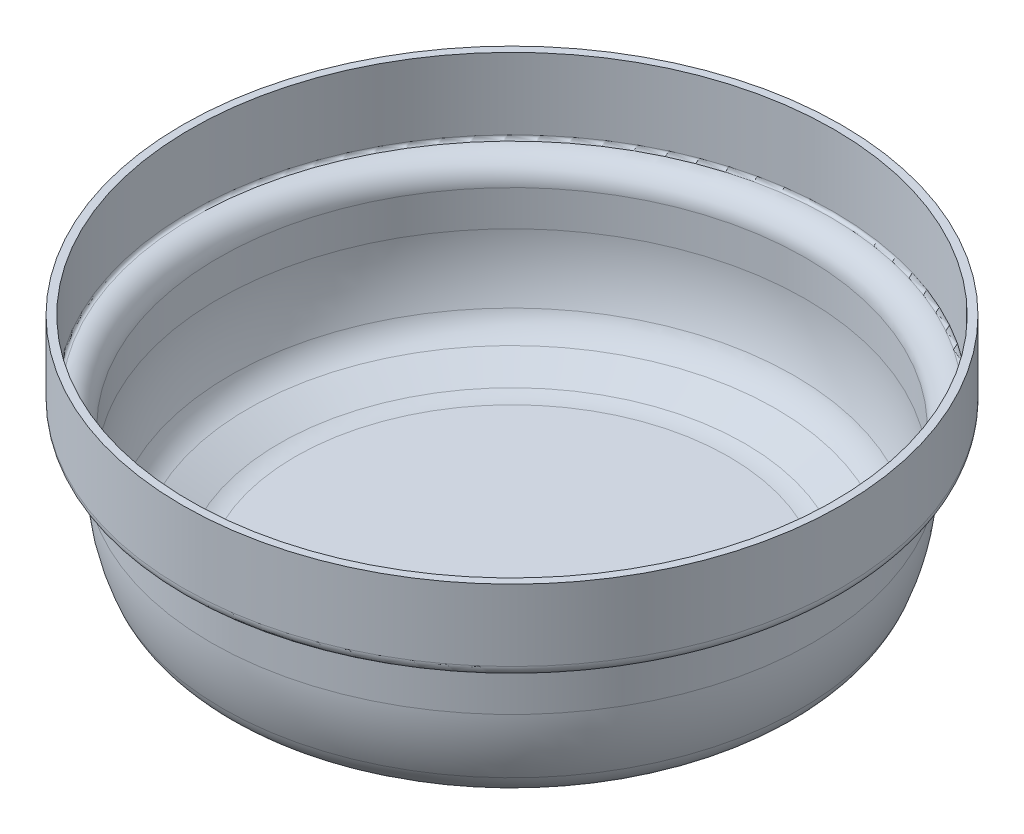
ISO-10303-21;
HEADER;
FILE_DESCRIPTION(('STEP AP214'),'2;1');
FILE_NAME('part.step','',(''),(''),'','','');
FILE_SCHEMA(('AUTOMOTIVE_DESIGN { 1 0 10303 214 1 1 1 1 }'));
ENDSEC;
DATA;
#1=APPLICATION_CONTEXT('core data for automotive mechanical design processes');
#2=APPLICATION_PROTOCOL_DEFINITION('international standard','automotive_design',2000,#1);
#3=PRODUCT_CONTEXT('',#1,'mechanical');
#4=PRODUCT('Part','Part','',(#3));
#5=PRODUCT_RELATED_PRODUCT_CATEGORY('part','',(#4));
#6=PRODUCT_DEFINITION_FORMATION('','',#4);
#7=PRODUCT_DEFINITION_CONTEXT('part definition',#1,'design');
#8=PRODUCT_DEFINITION('design','',#6,#7);
#9=PRODUCT_DEFINITION_SHAPE('','',#8);
#10=(LENGTH_UNIT() NAMED_UNIT(*) SI_UNIT(.MILLI.,.METRE.));
#11=(NAMED_UNIT(*) PLANE_ANGLE_UNIT() SI_UNIT($,.RADIAN.));
#12=(NAMED_UNIT(*) SI_UNIT($,.STERADIAN.) SOLID_ANGLE_UNIT());
#13=UNCERTAINTY_MEASURE_WITH_UNIT(LENGTH_MEASURE(1.E-05),#10,'distance_accuracy_value','');
#14=(GEOMETRIC_REPRESENTATION_CONTEXT(3) GLOBAL_UNCERTAINTY_ASSIGNED_CONTEXT((#13)) GLOBAL_UNIT_ASSIGNED_CONTEXT((#10,
#11,#12)) REPRESENTATION_CONTEXT('',''));
#15=CARTESIAN_POINT('',(0.,0.,0.));
#16=DIRECTION('',(0.,0.,1.));
#17=DIRECTION('',(1.,0.,0.));
#18=AXIS2_PLACEMENT_3D('',#15,#16,#17);
#19=CARTESIAN_POINT('',(0.,113.365316058993,0.));
#20=DIRECTION('',(0.,1.,0.));
#21=DIRECTION('',(0.,0.,1.));
#22=AXIS2_PLACEMENT_3D('',#19,#20,#21);
#23=PLANE('',#22);
#24=CARTESIAN_POINT('',(0.,113.365316058993,0.));
#25=DIRECTION('',(0.,-1.,0.));
#26=DIRECTION('',(0.,0.,-1.));
#27=AXIS2_PLACEMENT_3D('',#24,#25,#26);
#28=CIRCLE('',#27,135.355289406168);
#29=CARTESIAN_POINT('',(0.,113.365316058993,-135.355289406168));
#30=VERTEX_POINT('',#29);
#31=EDGE_CURVE('E66',#30,#30,#28,.T.);
#32=ORIENTED_EDGE('',*,*,#31,.T.);
#33=EDGE_LOOP('',(#32));
#34=FACE_BOUND('',#33,.T.);
#35=CARTESIAN_POINT('',(0.,113.365316058993,0.));
#36=DIRECTION('',(0.,-1.,0.));
#37=DIRECTION('',(0.,0.,-1.));
#38=AXIS2_PLACEMENT_3D('',#35,#36,#37);
#39=CIRCLE('',#38,138.555289406168);
#40=CARTESIAN_POINT('',(0.,113.365316058993,-138.555289406168));
#41=VERTEX_POINT('',#40);
#42=EDGE_CURVE('E73',#41,#41,#39,.T.);
#43=ORIENTED_EDGE('',*,*,#42,.F.);
#44=EDGE_LOOP('',(#43));
#45=FACE_BOUND('',#44,.T.);
#46=ADVANCED_FACE('F35',(#34,#45),#23,.T.);
#47=CARTESIAN_POINT('',(0.,14.832128030832,99.2127252525066));
#48=CARTESIAN_POINT('',(0.,13.6614165071201,96.7096580848795));
#49=CARTESIAN_POINT('',(0.,13.0472913738794,93.9930756489206));
#50=CARTESIAN_POINT('',(0.,13.0472913738795,91.1860000000004));
#51=(BOUNDED_CURVE() B_SPLINE_CURVE(3,(#47,#48,#49,#50),.UNSPECIFIED.,.F.,
.F.) B_SPLINE_CURVE_WITH_KNOTS((4,4),(0.,1.),
.UNSPECIFIED.) CURVE() GEOMETRIC_REPRESENTATION_ITEM() RATIONAL_B_SPLINE_CURVE((0.266833191114025,
0.258499793724843,0.254333095030252,0.254333095030252)) REPRESENTATION_ITEM(''));
#52=CARTESIAN_POINT('',(0.,55.,0.));
#53=DIRECTION('',(0.,-1.,0.));
#54=AXIS1_PLACEMENT('',#52,#53);
#55=SURFACE_OF_REVOLUTION('',#51,#54);
#56=OFFSET_SURFACE('',#55,-3.2,.F.);
#57=CARTESIAN_POINT('',(0.,16.2472913738796,0.));
#58=DIRECTION('',(0.,-1.,0.));
#59=DIRECTION('',(0.,0.,-1.));
#60=AXIS2_PLACEMENT_3D('',#57,#58,#59);
#61=CIRCLE('',#60,91.1860000000005);
#62=CARTESIAN_POINT('',(0.,16.2472913738796,-91.1860000000005));
#63=VERTEX_POINT('',#62);
#64=EDGE_CURVE('E50',#63,#63,#61,.T.);
#65=ORIENTED_EDGE('',*,*,#64,.T.);
#66=EDGE_LOOP('',(#65));
#67=FACE_BOUND('',#66,.T.);
#68=CARTESIAN_POINT('',(0.,17.7307532145668,0.));
#69=DIRECTION('',(0.,1.,0.));
#70=DIRECTION('',(0.,0.,1.));
#71=AXIS2_PLACEMENT_3D('',#68,#69,#70);
#72=CIRCLE('',#71,97.8570069763819);
#73=CARTESIAN_POINT('',(0.,17.7307532145668,97.8570069763819));
#74=VERTEX_POINT('',#73);
#75=EDGE_CURVE('E10',#74,#74,#72,.F.);
#76=ORIENTED_EDGE('',*,*,#75,.F.);
#77=EDGE_LOOP('',(#76));
#78=FACE_BOUND('',#77,.T.);
#79=ADVANCED_FACE('F87',(#67,#78),#56,.F.);
#80=CARTESIAN_POINT('',(0.,23.851107688811,0.));
#81=DIRECTION('',(0.,1.,0.));
#82=DIRECTION('',(0.,0.,1.));
#83=AXIS2_PLACEMENT_3D('',#80,#81,#82);
#84=CONICAL_SURFACE('',#83,110.942774074794,1.13331210913786);
#85=ORIENTED_EDGE('',*,*,#75,.T.);
#86=EDGE_LOOP('',(#85));
#87=FACE_BOUND('',#86,.T.);
#88=CARTESIAN_POINT('',(0.,23.851107688811,0.));
#89=DIRECTION('',(0.,-1.,0.));
#90=DIRECTION('',(0.,0.,-1.));
#91=AXIS2_PLACEMENT_3D('',#88,#89,#90);
#92=CIRCLE('',#91,110.942774074794);
#93=CARTESIAN_POINT('',(0.,23.851107688811,-110.942774074794));
#94=VERTEX_POINT('',#93);
#95=EDGE_CURVE('E42',#94,#94,#92,.T.);
#96=ORIENTED_EDGE('',*,*,#95,.F.);
#97=EDGE_LOOP('',(#96));
#98=FACE_BOUND('',#97,.T.);
#99=ADVANCED_FACE('F89',(#87,#98),#84,.F.);
#100=CARTESIAN_POINT('',(0.,37.6315363697442,0.));
#101=DIRECTION('',(0.,-1.,0.));
#102=DIRECTION('',(0.,0.,-1.));
#103=AXIS2_PLACEMENT_3D('',#100,#101,#102);
#104=TOROIDAL_SURFACE('',#103,104.49751888264,15.2132024610953);
#105=ORIENTED_EDGE('',*,*,#95,.T.);
#106=EDGE_LOOP('',(#105));
#107=FACE_BOUND('',#106,.T.);
#108=CARTESIAN_POINT('',(0.,32.0566764638808,0.));
#109=DIRECTION('',(0.,-1.,0.));
#110=DIRECTION('',(0.,0.,-1.));
#111=AXIS2_PLACEMENT_3D('',#108,#109,#110);
#112=CIRCLE('',#111,118.652463819031);
#113=CARTESIAN_POINT('',(0.,32.0566764638808,-118.652463819031));
#114=VERTEX_POINT('',#113);
#115=EDGE_CURVE('E47',#114,#114,#112,.T.);
#116=ORIENTED_EDGE('',*,*,#115,.F.);
#117=EDGE_LOOP('',(#116));
#118=FACE_BOUND('',#117,.T.);
#119=ADVANCED_FACE('F92',(#107,#118),#104,.F.);
#120=CARTESIAN_POINT('',(0.,57.5011211482528,0.));
#121=DIRECTION('',(0.,-1.,0.));
#122=DIRECTION('',(0.,0.,-1.));
#123=AXIS2_PLACEMENT_3D('',#120,#121,#122);
#124=DEGENERATE_TOROIDAL_SURFACE('',#123,54.0473043126088,69.4351956873913,.T.);
#125=ORIENTED_EDGE('',*,*,#115,.T.);
#126=EDGE_LOOP('',(#125));
#127=FACE_BOUND('',#126,.T.);
#128=CARTESIAN_POINT('',(0.,57.5011211482528,0.));
#129=DIRECTION('',(0.,-1.,0.));
#130=DIRECTION('',(0.,0.,-1.));
#131=AXIS2_PLACEMENT_3D('',#128,#129,#130);
#132=CIRCLE('',#131,123.4825);
#133=CARTESIAN_POINT('',(0.,57.5011211482528,-123.4825));
#134=VERTEX_POINT('',#133);
#135=EDGE_CURVE('E54',#134,#134,#132,.T.);
#136=ORIENTED_EDGE('',*,*,#135,.F.);
#137=EDGE_LOOP('',(#136));
#138=FACE_BOUND('',#137,.T.);
#139=ADVANCED_FACE('F95',(#127,#138),#124,.F.);
#140=CARTESIAN_POINT('',(0.,55.,0.));
#141=DIRECTION('',(0.,-1.,0.));
#142=DIRECTION('',(0.,0.,-1.));
#143=AXIS2_PLACEMENT_3D('',#140,#141,#142);
#144=CYLINDRICAL_SURFACE('',#143,123.4825);
#145=ORIENTED_EDGE('',*,*,#135,.T.);
#146=EDGE_LOOP('',(#145));
#147=FACE_BOUND('',#146,.T.);
#148=CARTESIAN_POINT('',(0.,72.5011211482528,0.));
#149=DIRECTION('',(0.,-1.,0.));
#150=DIRECTION('',(0.,0.,-1.));
#151=AXIS2_PLACEMENT_3D('',#148,#149,#150);
#152=CIRCLE('',#151,123.4825);
#153=CARTESIAN_POINT('',(0.,72.5011211482528,-123.4825));
#154=VERTEX_POINT('',#153);
#155=EDGE_CURVE('E57',#154,#154,#152,.T.);
#156=ORIENTED_EDGE('',*,*,#155,.F.);
#157=EDGE_LOOP('',(#156));
#158=FACE_BOUND('',#157,.T.);
#159=ADVANCED_FACE('F99',(#147,#158),#144,.F.);
#160=CARTESIAN_POINT('',(0.,72.5011211482528,0.));
#161=DIRECTION('',(0.,-1.,0.));
#162=DIRECTION('',(0.,0.,-1.));
#163=AXIS2_PLACEMENT_3D('',#160,#161,#162);
#164=TOROIDAL_SURFACE('',#163,133.0325,9.54999999999996);
#165=ORIENTED_EDGE('',*,*,#155,.T.);
#166=EDGE_LOOP('',(#165));
#167=FACE_BOUND('',#166,.T.);
#168=CARTESIAN_POINT('',(0.,82.003251172621,0.));
#169=DIRECTION('',(0.,-1.,0.));
#170=DIRECTION('',(0.,0.,-1.));
#171=AXIS2_PLACEMENT_3D('',#168,#169,#170);
#172=CIRCLE('',#171,133.9875);
#173=CARTESIAN_POINT('',(0.,82.003251172621,-133.9875));
#174=VERTEX_POINT('',#173);
#175=EDGE_CURVE('E60',#174,#174,#172,.T.);
#176=ORIENTED_EDGE('',*,*,#175,.F.);
#177=EDGE_LOOP('',(#176));
#178=FACE_BOUND('',#177,.T.);
#179=ADVANCED_FACE('F103',(#167,#178),#164,.T.);
#180=CARTESIAN_POINT('',(0.,83.2420105318187,0.));
#181=DIRECTION('',(0.,-1.,0.));
#182=DIRECTION('',(0.,0.,-1.));
#183=AXIS2_PLACEMENT_3D('',#180,#181,#182);
#184=TOROIDAL_SURFACE('',#183,134.112,1.24499999999991);
#185=ORIENTED_EDGE('',*,*,#175,.T.);
#186=EDGE_LOOP('',(#185));
#187=FACE_BOUND('',#186,.T.);
#188=CARTESIAN_POINT('',(0.,83.3072520255906,0.));
#189=DIRECTION('',(0.,-1.,0.));
#190=DIRECTION('',(0.,0.,-1.));
#191=AXIS2_PLACEMENT_3D('',#188,#189,#190);
#192=CIRCLE('',#191,135.355289406168);
#193=CARTESIAN_POINT('',(0.,83.3072520255906,-135.355289406168));
#194=VERTEX_POINT('',#193);
#195=EDGE_CURVE('E63',#194,#194,#192,.T.);
#196=ORIENTED_EDGE('',*,*,#195,.F.);
#197=EDGE_LOOP('',(#196));
#198=FACE_BOUND('',#197,.T.);
#199=ADVANCED_FACE('F107',(#187,#198),#184,.F.);
#200=CARTESIAN_POINT('',(0.,55.,0.));
#201=DIRECTION('',(0.,-1.,0.));
#202=DIRECTION('',(0.,0.,-1.));
#203=AXIS2_PLACEMENT_3D('',#200,#201,#202);
#204=CYLINDRICAL_SURFACE('',#203,135.355289406168);
#205=ORIENTED_EDGE('',*,*,#195,.T.);
#206=EDGE_LOOP('',(#205));
#207=FACE_BOUND('',#206,.T.);
#208=ORIENTED_EDGE('',*,*,#31,.F.);
#209=EDGE_LOOP('',(#208));
#210=FACE_BOUND('',#209,.T.);
#211=ADVANCED_FACE('F85',(#207,#210),#204,.F.);
#212=CARTESIAN_POINT('',(0.,14.832128030832,99.2127252525066));
#213=CARTESIAN_POINT('',(0.,13.6614165071201,96.7096580848795));
#214=CARTESIAN_POINT('',(0.,13.0472913738794,93.9930756489206));
#215=CARTESIAN_POINT('',(0.,13.0472913738795,91.1860000000004));
#216=(BOUNDED_CURVE() B_SPLINE_CURVE(3,(#212,#213,#214,#215),.UNSPECIFIED.,.F.,
.F.) B_SPLINE_CURVE_WITH_KNOTS((4,4),(0.,1.),
.UNSPECIFIED.) CURVE() GEOMETRIC_REPRESENTATION_ITEM() RATIONAL_B_SPLINE_CURVE((0.266833191114025,
0.258499793724843,0.254333095030252,0.254333095030252)) REPRESENTATION_ITEM(''));
#217=CARTESIAN_POINT('',(0.,55.,0.));
#218=DIRECTION('',(0.,-1.,0.));
#219=AXIS1_PLACEMENT('',#217,#218);
#220=SURFACE_OF_REVOLUTION('',#216,#219);
#221=CARTESIAN_POINT('',(0.,13.0472913738795,0.));
#222=DIRECTION('',(0.,-1.,0.));
#223=DIRECTION('',(0.,0.,-1.));
#224=AXIS2_PLACEMENT_3D('',#221,#222,#223);
#225=CIRCLE('',#224,91.1860000000004);
#226=CARTESIAN_POINT('',(0.,13.0472913738795,-91.1860000000004));
#227=VERTEX_POINT('',#226);
#228=EDGE_CURVE('E38',#227,#227,#225,.T.);
#229=ORIENTED_EDGE('',*,*,#228,.F.);
#230=EDGE_LOOP('',(#229));
#231=FACE_BOUND('',#230,.T.);
#232=CARTESIAN_POINT('',(0.,14.832128030832,0.));
#233=DIRECTION('',(0.,-1.,0.));
#234=DIRECTION('',(0.,0.,-1.));
#235=AXIS2_PLACEMENT_3D('',#232,#233,#234);
#236=CIRCLE('',#235,99.2127252525066);
#237=CARTESIAN_POINT('',(0.,14.832128030832,-99.2127252525066));
#238=VERTEX_POINT('',#237);
#239=EDGE_CURVE('E174',#238,#238,#236,.T.);
#240=ORIENTED_EDGE('',*,*,#239,.T.);
#241=EDGE_LOOP('',(#240));
#242=FACE_BOUND('',#241,.T.);
#243=ADVANCED_FACE('F79',(#231,#242),#220,.T.);
#244=CARTESIAN_POINT('',(0.,20.9524825050762,0.));
#245=DIRECTION('',(0.,1.,0.));
#246=DIRECTION('',(0.,0.,1.));
#247=AXIS2_PLACEMENT_3D('',#244,#245,#246);
#248=CONICAL_SURFACE('',#247,112.298492350919,1.13331210913786);
#249=ORIENTED_EDGE('',*,*,#239,.F.);
#250=EDGE_LOOP('',(#249));
#251=FACE_BOUND('',#250,.T.);
#252=CARTESIAN_POINT('',(0.,20.9524825050762,0.));
#253=DIRECTION('',(0.,-1.,0.));
#254=DIRECTION('',(0.,0.,-1.));
#255=AXIS2_PLACEMENT_3D('',#252,#253,#254);
#256=CIRCLE('',#255,112.298492350919);
#257=CARTESIAN_POINT('',(0.,20.9524825050762,-112.298492350919));
#258=VERTEX_POINT('',#257);
#259=EDGE_CURVE('E176',#258,#258,#256,.T.);
#260=ORIENTED_EDGE('',*,*,#259,.T.);
#261=EDGE_LOOP('',(#260));
#262=FACE_BOUND('',#261,.T.);
#263=ADVANCED_FACE('F84',(#251,#262),#248,.T.);
#264=CARTESIAN_POINT('',(0.,37.6315363697442,0.));
#265=DIRECTION('',(0.,-1.,0.));
#266=DIRECTION('',(0.,0.,-1.));
#267=AXIS2_PLACEMENT_3D('',#264,#265,#266);
#268=TOROIDAL_SURFACE('',#267,104.49751888264,18.4132024610953);
#269=ORIENTED_EDGE('',*,*,#259,.F.);
#270=EDGE_LOOP('',(#269));
#271=FACE_BOUND('',#270,.T.);
#272=CARTESIAN_POINT('',(0.,30.8840402786734,0.));
#273=DIRECTION('',(0.,-1.,0.));
#274=DIRECTION('',(0.,0.,-1.));
#275=AXIS2_PLACEMENT_3D('',#272,#273,#274);
#276=CIRCLE('',#275,121.629866105781);
#277=CARTESIAN_POINT('',(0.,30.8840402786734,-121.629866105781));
#278=VERTEX_POINT('',#277);
#279=EDGE_CURVE('E179',#278,#278,#276,.T.);
#280=ORIENTED_EDGE('',*,*,#279,.T.);
#281=EDGE_LOOP('',(#280));
#282=FACE_BOUND('',#281,.T.);
#283=ADVANCED_FACE('F135',(#271,#282),#268,.T.);
#284=CARTESIAN_POINT('',(0.,57.5011211482528,0.));
#285=DIRECTION('',(0.,-1.,0.));
#286=DIRECTION('',(0.,0.,-1.));
#287=AXIS2_PLACEMENT_3D('',#284,#285,#286);
#288=DEGENERATE_TOROIDAL_SURFACE('',#287,54.0473043126088,72.6351956873913,.T.);
#289=ORIENTED_EDGE('',*,*,#279,.F.);
#290=EDGE_LOOP('',(#289));
#291=FACE_BOUND('',#290,.T.);
#292=CARTESIAN_POINT('',(0.,57.5011211482528,0.));
#293=DIRECTION('',(0.,-1.,0.));
#294=DIRECTION('',(0.,0.,-1.));
#295=AXIS2_PLACEMENT_3D('',#292,#293,#294);
#296=CIRCLE('',#295,126.6825);
#297=CARTESIAN_POINT('',(0.,57.5011211482528,-126.6825));
#298=VERTEX_POINT('',#297);
#299=EDGE_CURVE('E184',#298,#298,#296,.T.);
#300=ORIENTED_EDGE('',*,*,#299,.T.);
#301=EDGE_LOOP('',(#300));
#302=FACE_BOUND('',#301,.T.);
#303=ADVANCED_FACE('F131',(#291,#302),#288,.T.);
#304=CARTESIAN_POINT('',(0.,55.,0.));
#305=DIRECTION('',(0.,-1.,0.));
#306=DIRECTION('',(0.,0.,-1.));
#307=AXIS2_PLACEMENT_3D('',#304,#305,#306);
#308=CYLINDRICAL_SURFACE('',#307,126.6825);
#309=ORIENTED_EDGE('',*,*,#299,.F.);
#310=EDGE_LOOP('',(#309));
#311=FACE_BOUND('',#310,.T.);
#312=CARTESIAN_POINT('',(0.,72.5011211482528,0.));
#313=DIRECTION('',(0.,-1.,0.));
#314=DIRECTION('',(0.,0.,-1.));
#315=AXIS2_PLACEMENT_3D('',#312,#313,#314);
#316=CIRCLE('',#315,126.6825);
#317=CARTESIAN_POINT('',(0.,72.5011211482528,-126.6825));
#318=VERTEX_POINT('',#317);
#319=EDGE_CURVE('E187',#318,#318,#316,.T.);
#320=ORIENTED_EDGE('',*,*,#319,.T.);
#321=EDGE_LOOP('',(#320));
#322=FACE_BOUND('',#321,.T.);
#323=ADVANCED_FACE('F127',(#311,#322),#308,.T.);
#324=CARTESIAN_POINT('',(0.,72.5011211482528,0.));
#325=DIRECTION('',(0.,-1.,0.));
#326=DIRECTION('',(0.,0.,-1.));
#327=AXIS2_PLACEMENT_3D('',#324,#325,#326);
#328=TOROIDAL_SURFACE('',#327,133.0325,6.34999999999996);
#329=ORIENTED_EDGE('',*,*,#319,.F.);
#330=EDGE_LOOP('',(#329));
#331=FACE_BOUND('',#330,.T.);
#332=CARTESIAN_POINT('',(0.,78.8192913738797,0.));
#333=DIRECTION('',(0.,-1.,0.));
#334=DIRECTION('',(0.,0.,-1.));
#335=AXIS2_PLACEMENT_3D('',#332,#333,#334);
#336=CIRCLE('',#335,133.667500000001);
#337=CARTESIAN_POINT('',(0.,78.8192913738797,-133.667500000001));
#338=VERTEX_POINT('',#337);
#339=EDGE_CURVE('E158',#338,#338,#336,.T.);
#340=ORIENTED_EDGE('',*,*,#339,.T.);
#341=EDGE_LOOP('',(#340));
#342=FACE_BOUND('',#341,.T.);
#343=ADVANCED_FACE('F123',(#331,#342),#328,.F.);
#344=CARTESIAN_POINT('',(0.,83.2420105318187,0.));
#345=DIRECTION('',(0.,-1.,0.));
#346=DIRECTION('',(0.,0.,-1.));
#347=AXIS2_PLACEMENT_3D('',#344,#345,#346);
#348=TOROIDAL_SURFACE('',#347,134.112,4.44499999999991);
#349=ORIENTED_EDGE('',*,*,#339,.F.);
#350=EDGE_LOOP('',(#349));
#351=FACE_BOUND('',#350,.T.);
#352=CARTESIAN_POINT('',(0.,83.3653160589928,0.));
#353=DIRECTION('',(0.,-1.,0.));
#354=DIRECTION('',(0.,0.,-1.));
#355=AXIS2_PLACEMENT_3D('',#352,#353,#354);
#356=CIRCLE('',#355,138.555289406168);
#357=CARTESIAN_POINT('',(0.,83.3653160589928,-138.555289406168));
#358=VERTEX_POINT('',#357);
#359=EDGE_CURVE('E156',#358,#358,#356,.T.);
#360=ORIENTED_EDGE('',*,*,#359,.T.);
#361=EDGE_LOOP('',(#360));
#362=FACE_BOUND('',#361,.T.);
#363=ADVANCED_FACE('F119',(#351,#362),#348,.T.);
#364=CARTESIAN_POINT('',(0.,55.,0.));
#365=DIRECTION('',(0.,-1.,0.));
#366=DIRECTION('',(0.,0.,-1.));
#367=AXIS2_PLACEMENT_3D('',#364,#365,#366);
#368=CYLINDRICAL_SURFACE('',#367,138.555289406168);
#369=ORIENTED_EDGE('',*,*,#359,.F.);
#370=EDGE_LOOP('',(#369));
#371=FACE_BOUND('',#370,.T.);
#372=ORIENTED_EDGE('',*,*,#42,.T.);
#373=EDGE_LOOP('',(#372));
#374=FACE_BOUND('',#373,.T.);
#375=ADVANCED_FACE('F115',(#371,#374),#368,.T.);
#376=CARTESIAN_POINT('',(0.,16.2472913738795,91.1860000000005));
#377=DIRECTION('',(0.,1.,0.));
#378=DIRECTION('',(0.,0.,1.));
#379=AXIS2_PLACEMENT_3D('',#376,#377,#378);
#380=PLANE('',#379);
#381=ORIENTED_EDGE('',*,*,#64,.F.);
#382=EDGE_LOOP('',(#381));
#383=FACE_BOUND('',#382,.T.);
#384=ADVANCED_FACE('F118',(#383),#380,.T.);
#385=CARTESIAN_POINT('',(0.,13.0472913738795,91.1860000000005));
#386=DIRECTION('',(0.,1.,0.));
#387=DIRECTION('',(0.,0.,1.));
#388=AXIS2_PLACEMENT_3D('',#385,#386,#387);
#389=PLANE('',#388);
#390=ORIENTED_EDGE('',*,*,#228,.T.);
#391=EDGE_LOOP('',(#390));
#392=FACE_BOUND('',#391,.T.);
#393=ADVANCED_FACE('F164',(#392),#389,.F.);
#394=CLOSED_SHELL('',(#46,#79,#99,#119,#139,#159,#179,#199,#211,#243,#263,#283,#303,#323,#343,
#363,#375,#384,#393));
#395=MANIFOLD_SOLID_BREP('B2',#394);
#396=ADVANCED_BREP_SHAPE_REPRESENTATION('',(#18,#395),#14);
#397=SHAPE_DEFINITION_REPRESENTATION(#9,#396);
ENDSEC;
END-ISO-10303-21;
